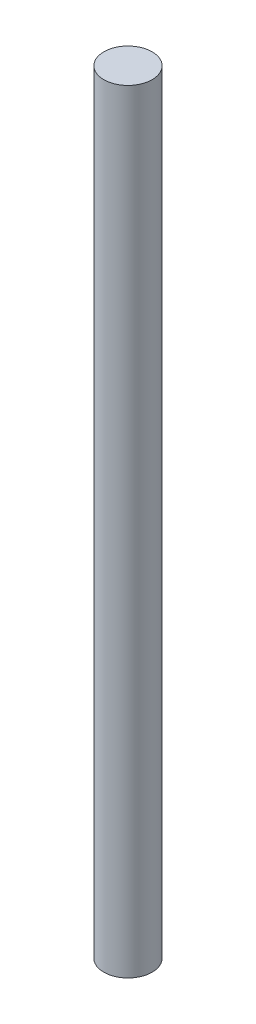
ISO-10303-21;
HEADER;
FILE_DESCRIPTION(('STEP AP214'),'2;1');
FILE_NAME('part.step','',(''),(''),'','','');
FILE_SCHEMA(('AUTOMOTIVE_DESIGN { 1 0 10303 214 1 1 1 1 }'));
ENDSEC;
DATA;
#1=APPLICATION_CONTEXT('core data for automotive mechanical design processes');
#2=APPLICATION_PROTOCOL_DEFINITION('international standard','automotive_design',2000,#1);
#3=PRODUCT_CONTEXT('',#1,'mechanical');
#4=PRODUCT('Part','Part','',(#3));
#5=PRODUCT_RELATED_PRODUCT_CATEGORY('part','',(#4));
#6=PRODUCT_DEFINITION_FORMATION('','',#4);
#7=PRODUCT_DEFINITION_CONTEXT('part definition',#1,'design');
#8=PRODUCT_DEFINITION('design','',#6,#7);
#9=PRODUCT_DEFINITION_SHAPE('','',#8);
#10=(LENGTH_UNIT() NAMED_UNIT(*) SI_UNIT(.MILLI.,.METRE.));
#11=(NAMED_UNIT(*) PLANE_ANGLE_UNIT() SI_UNIT($,.RADIAN.));
#12=(NAMED_UNIT(*) SI_UNIT($,.STERADIAN.) SOLID_ANGLE_UNIT());
#13=UNCERTAINTY_MEASURE_WITH_UNIT(LENGTH_MEASURE(1.E-05),#10,'distance_accuracy_value','');
#14=(GEOMETRIC_REPRESENTATION_CONTEXT(3) GLOBAL_UNCERTAINTY_ASSIGNED_CONTEXT((#13)) GLOBAL_UNIT_ASSIGNED_CONTEXT((#10,
#11,#12)) REPRESENTATION_CONTEXT('',''));
#15=CARTESIAN_POINT('',(0.,0.,0.));
#16=DIRECTION('',(0.,0.,1.));
#17=DIRECTION('',(1.,0.,0.));
#18=AXIS2_PLACEMENT_3D('',#15,#16,#17);
#19=CARTESIAN_POINT('',(0.,127.,0.));
#20=DIRECTION('',(0.,-1.,0.));
#21=DIRECTION('',(0.,0.,-1.));
#22=AXIS2_PLACEMENT_3D('',#19,#20,#21);
#23=CYLINDRICAL_SURFACE('',#22,3.96875);
#24=CARTESIAN_POINT('',(0.,127.,0.));
#25=DIRECTION('',(0.,1.,0.));
#26=DIRECTION('',(0.,0.,1.));
#27=AXIS2_PLACEMENT_3D('',#24,#25,#26);
#28=CIRCLE('',#27,3.96875);
#29=CARTESIAN_POINT('',(0.,127.,3.96875));
#30=VERTEX_POINT('',#29);
#31=EDGE_CURVE('E10',#30,#30,#28,.T.);
#32=ORIENTED_EDGE('',*,*,#31,.F.);
#33=EDGE_LOOP('',(#32));
#34=FACE_BOUND('',#33,.T.);
#35=CARTESIAN_POINT('',(0.,0.,0.));
#36=DIRECTION('',(0.,1.,0.));
#37=DIRECTION('',(0.,0.,1.));
#38=AXIS2_PLACEMENT_3D('',#35,#36,#37);
#39=CIRCLE('',#38,3.96875);
#40=CARTESIAN_POINT('',(0.,0.,3.96875));
#41=VERTEX_POINT('',#40);
#42=EDGE_CURVE('E34',#41,#41,#39,.T.);
#43=ORIENTED_EDGE('',*,*,#42,.T.);
#44=EDGE_LOOP('',(#43));
#45=FACE_BOUND('',#44,.T.);
#46=ADVANCED_FACE('F31',(#34,#45),#23,.T.);
#47=CARTESIAN_POINT('',(0.,127.,0.));
#48=DIRECTION('',(0.,1.,0.));
#49=DIRECTION('',(0.,0.,1.));
#50=AXIS2_PLACEMENT_3D('',#47,#48,#49);
#51=PLANE('',#50);
#52=ORIENTED_EDGE('',*,*,#31,.T.);
#53=EDGE_LOOP('',(#52));
#54=FACE_BOUND('',#53,.T.);
#55=ADVANCED_FACE('F46',(#54),#51,.T.);
#56=CARTESIAN_POINT('',(0.,0.,0.));
#57=DIRECTION('',(0.,1.,0.));
#58=DIRECTION('',(0.,0.,1.));
#59=AXIS2_PLACEMENT_3D('',#56,#57,#58);
#60=PLANE('',#59);
#61=ORIENTED_EDGE('',*,*,#42,.F.);
#62=EDGE_LOOP('',(#61));
#63=FACE_BOUND('',#62,.T.);
#64=ADVANCED_FACE('F44',(#63),#60,.F.);
#65=CLOSED_SHELL('',(#46,#55,#64));
#66=MANIFOLD_SOLID_BREP('B2',#65);
#67=ADVANCED_BREP_SHAPE_REPRESENTATION('',(#18,#66),#14);
#68=SHAPE_DEFINITION_REPRESENTATION(#9,#67);
ENDSEC;
END-ISO-10303-21;
